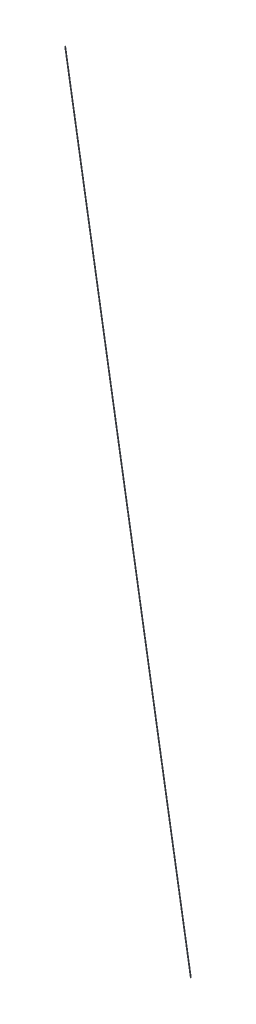
ISO-10303-21;
HEADER;
FILE_DESCRIPTION(('STEP AP214'),'2;1');
FILE_NAME('part.step','',(''),(''),'','','');
FILE_SCHEMA(('AUTOMOTIVE_DESIGN { 1 0 10303 214 1 1 1 1 }'));
ENDSEC;
DATA;
#1=APPLICATION_CONTEXT('core data for automotive mechanical design processes');
#2=APPLICATION_PROTOCOL_DEFINITION('international standard','automotive_design',2000,#1);
#3=PRODUCT_CONTEXT('',#1,'mechanical');
#4=PRODUCT('Part','Part','',(#3));
#5=PRODUCT_RELATED_PRODUCT_CATEGORY('part','',(#4));
#6=PRODUCT_DEFINITION_FORMATION('','',#4);
#7=PRODUCT_DEFINITION_CONTEXT('part definition',#1,'design');
#8=PRODUCT_DEFINITION('design','',#6,#7);
#9=PRODUCT_DEFINITION_SHAPE('','',#8);
#10=(LENGTH_UNIT() NAMED_UNIT(*) SI_UNIT(.MILLI.,.METRE.));
#11=(NAMED_UNIT(*) PLANE_ANGLE_UNIT() SI_UNIT($,.RADIAN.));
#12=(NAMED_UNIT(*) SI_UNIT($,.STERADIAN.) SOLID_ANGLE_UNIT());
#13=UNCERTAINTY_MEASURE_WITH_UNIT(LENGTH_MEASURE(1.E-05),#10,'distance_accuracy_value','');
#14=(GEOMETRIC_REPRESENTATION_CONTEXT(3) GLOBAL_UNCERTAINTY_ASSIGNED_CONTEXT((#13)) GLOBAL_UNIT_ASSIGNED_CONTEXT((#10,
#11,#12)) REPRESENTATION_CONTEXT('',''));
#15=CARTESIAN_POINT('',(0.,0.,0.));
#16=DIRECTION('',(0.,0.,1.));
#17=DIRECTION('',(1.,0.,0.));
#18=AXIS2_PLACEMENT_3D('',#15,#16,#17);
#19=CARTESIAN_POINT('',(0.,0.,0.));
#20=DIRECTION('',(0.,0.989718015570063,0.143032337798331));
#21=DIRECTION('',(0.,-0.143032337798331,0.989718015570063));
#22=AXIS2_PLACEMENT_3D('',#19,#20,#21);
#23=PLANE('',#22);
#24=CARTESIAN_POINT('',(0.,0.,0.));
#25=DIRECTION('',(0.,0.989718015570063,0.143032337798331));
#26=DIRECTION('',(0.,-0.143032337798331,0.989718015570063));
#27=AXIS2_PLACEMENT_3D('',#24,#25,#26);
#28=CIRCLE('',#27,0.5);
#29=CARTESIAN_POINT('',(0.,-0.0715161688991657,0.494859007785032));
#30=VERTEX_POINT('',#29);
#31=EDGE_CURVE('E47',#30,#30,#28,.T.);
#32=ORIENTED_EDGE('',*,*,#31,.F.);
#33=EDGE_LOOP('',(#32));
#34=FACE_BOUND('',#33,.T.);
#35=ADVANCED_FACE('F41',(#34),#23,.F.);
#36=CARTESIAN_POINT('',(0.,1505.,217.5));
#37=DIRECTION('',(0.,0.989718015570063,0.143032337798331));
#38=DIRECTION('',(0.,-0.143032337798331,0.989718015570063));
#39=AXIS2_PLACEMENT_3D('',#36,#37,#38);
#40=PLANE('',#39);
#41=CARTESIAN_POINT('',(0.,1505.,217.5));
#42=DIRECTION('',(0.,0.989718015570063,0.143032337798331));
#43=DIRECTION('',(0.,-0.143032337798331,0.989718015570063));
#44=AXIS2_PLACEMENT_3D('',#41,#42,#43);
#45=CIRCLE('',#44,0.5);
#46=CARTESIAN_POINT('',(0.,1504.9284838311,217.994859007785));
#47=VERTEX_POINT('',#46);
#48=EDGE_CURVE('E11',#47,#47,#45,.T.);
#49=ORIENTED_EDGE('',*,*,#48,.T.);
#50=EDGE_LOOP('',(#49));
#51=FACE_BOUND('',#50,.T.);
#52=ADVANCED_FACE('F56',(#51),#40,.T.);
#53=CARTESIAN_POINT('',(0.,0.,0.));
#54=DIRECTION('',(0.,0.989718015570063,0.143032337798331));
#55=DIRECTION('',(0.,-0.143032337798331,0.989718015570063));
#56=AXIS2_PLACEMENT_3D('',#53,#54,#55);
#57=CYLINDRICAL_SURFACE('',#56,0.5);
#58=ORIENTED_EDGE('',*,*,#48,.F.);
#59=EDGE_LOOP('',(#58));
#60=FACE_BOUND('',#59,.T.);
#61=ORIENTED_EDGE('',*,*,#31,.T.);
#62=EDGE_LOOP('',(#61));
#63=FACE_BOUND('',#62,.T.);
#64=ADVANCED_FACE('F53',(#60,#63),#57,.T.);
#65=CLOSED_SHELL('',(#35,#52,#64));
#66=MANIFOLD_SOLID_BREP('B2',#65);
#67=ADVANCED_BREP_SHAPE_REPRESENTATION('',(#18,#66),#14);
#68=SHAPE_DEFINITION_REPRESENTATION(#9,#67);
ENDSEC;
END-ISO-10303-21;
